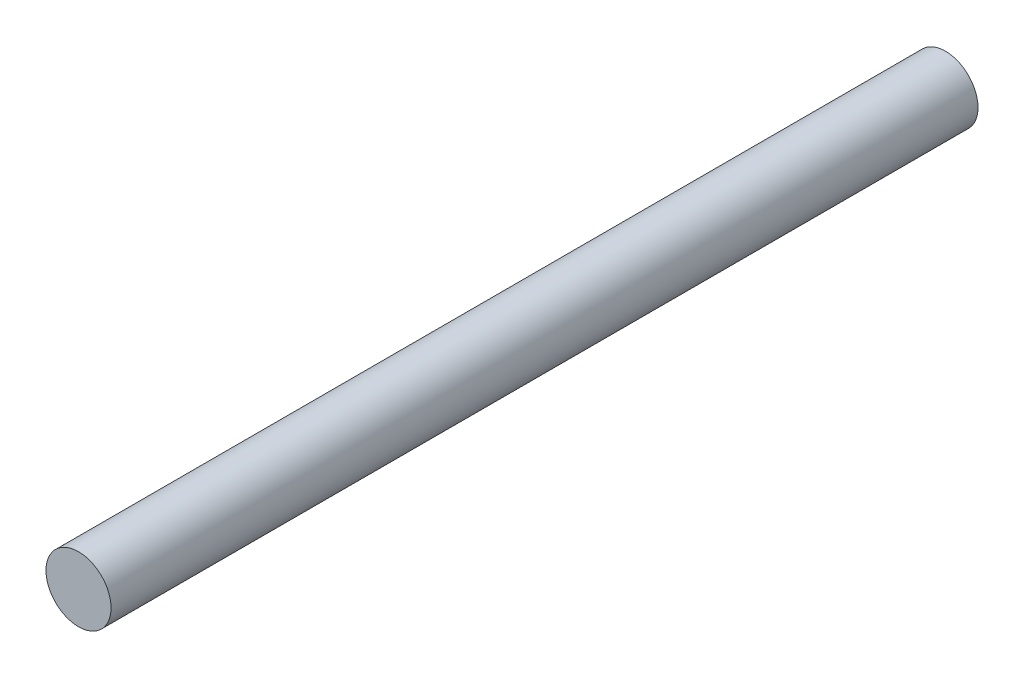
ISO-10303-21;
HEADER;
FILE_DESCRIPTION(('STEP AP214'),'2;1');
FILE_NAME('part.step','',(''),(''),'','','');
FILE_SCHEMA(('AUTOMOTIVE_DESIGN { 1 0 10303 214 1 1 1 1 }'));
ENDSEC;
DATA;
#1=APPLICATION_CONTEXT('core data for automotive mechanical design processes');
#2=APPLICATION_PROTOCOL_DEFINITION('international standard','automotive_design',2000,#1);
#3=PRODUCT_CONTEXT('',#1,'mechanical');
#4=PRODUCT('Part','Part','',(#3));
#5=PRODUCT_RELATED_PRODUCT_CATEGORY('part','',(#4));
#6=PRODUCT_DEFINITION_FORMATION('','',#4);
#7=PRODUCT_DEFINITION_CONTEXT('part definition',#1,'design');
#8=PRODUCT_DEFINITION('design','',#6,#7);
#9=PRODUCT_DEFINITION_SHAPE('','',#8);
#10=(LENGTH_UNIT() NAMED_UNIT(*) SI_UNIT(.MILLI.,.METRE.));
#11=(NAMED_UNIT(*) PLANE_ANGLE_UNIT() SI_UNIT($,.RADIAN.));
#12=(NAMED_UNIT(*) SI_UNIT($,.STERADIAN.) SOLID_ANGLE_UNIT());
#13=UNCERTAINTY_MEASURE_WITH_UNIT(LENGTH_MEASURE(1.E-05),#10,'distance_accuracy_value','');
#14=(GEOMETRIC_REPRESENTATION_CONTEXT(3) GLOBAL_UNCERTAINTY_ASSIGNED_CONTEXT((#13)) GLOBAL_UNIT_ASSIGNED_CONTEXT((#10,
#11,#12)) REPRESENTATION_CONTEXT('',''));
#15=CARTESIAN_POINT('',(0.,0.,0.));
#16=DIRECTION('',(0.,0.,1.));
#17=DIRECTION('',(1.,0.,0.));
#18=AXIS2_PLACEMENT_3D('',#15,#16,#17);
#19=CARTESIAN_POINT('',(36.068,1.17961196366423E-13,146.410680000001));
#20=DIRECTION('',(0.,0.,-1.));
#21=DIRECTION('',(-1.,0.,0.));
#22=AXIS2_PLACEMENT_3D('',#19,#20,#21);
#23=PLANE('',#22);
#24=CARTESIAN_POINT('',(36.068,1.17961196366423E-13,146.410680000001));
#25=DIRECTION('',(0.,0.,-1.));
#26=DIRECTION('',(-1.,0.,0.));
#27=AXIS2_PLACEMENT_3D('',#24,#25,#26);
#28=CIRCLE('',#27,6.35);
#29=CARTESIAN_POINT('',(29.718,1.17961196366423E-13,146.410680000001));
#30=VERTEX_POINT('',#29);
#31=EDGE_CURVE('E51',#30,#30,#28,.T.);
#32=ORIENTED_EDGE('',*,*,#31,.F.);
#33=EDGE_LOOP('',(#32));
#34=FACE_BOUND('',#33,.T.);
#35=ADVANCED_FACE('F44',(#34),#23,.F.);
#36=CARTESIAN_POINT('',(36.068,1.17961196366423E-13,-40.8205122421383));
#37=DIRECTION('',(0.,0.,1.));
#38=DIRECTION('',(1.,0.,0.));
#39=AXIS2_PLACEMENT_3D('',#36,#37,#38);
#40=CYLINDRICAL_SURFACE('',#39,6.35);
#41=CARTESIAN_POINT('',(36.068,1.17961196366423E-13,-22.86));
#42=DIRECTION('',(0.,0.,1.));
#43=DIRECTION('',(1.,0.,0.));
#44=AXIS2_PLACEMENT_3D('',#41,#42,#43);
#45=CIRCLE('',#44,6.35);
#46=CARTESIAN_POINT('',(42.418,1.17961196366423E-13,-22.86));
#47=VERTEX_POINT('',#46);
#48=EDGE_CURVE('E11',#47,#47,#45,.T.);
#49=ORIENTED_EDGE('',*,*,#48,.T.);
#50=EDGE_LOOP('',(#49));
#51=FACE_BOUND('',#50,.T.);
#52=ORIENTED_EDGE('',*,*,#31,.T.);
#53=EDGE_LOOP('',(#52));
#54=FACE_BOUND('',#53,.T.);
#55=ADVANCED_FACE('F46',(#51,#54),#40,.T.);
#56=CARTESIAN_POINT('',(0.,0.,-22.86));
#57=DIRECTION('',(0.,0.,1.));
#58=DIRECTION('',(1.,0.,0.));
#59=AXIS2_PLACEMENT_3D('',#56,#57,#58);
#60=PLANE('',#59);
#61=ORIENTED_EDGE('',*,*,#48,.F.);
#62=EDGE_LOOP('',(#61));
#63=FACE_BOUND('',#62,.T.);
#64=ADVANCED_FACE('F62',(#63),#60,.F.);
#65=CLOSED_SHELL('',(#35,#55,#64));
#66=MANIFOLD_SOLID_BREP('B2',#65);
#67=ADVANCED_BREP_SHAPE_REPRESENTATION('',(#18,#66),#14);
#68=SHAPE_DEFINITION_REPRESENTATION(#9,#67);
ENDSEC;
END-ISO-10303-21;
